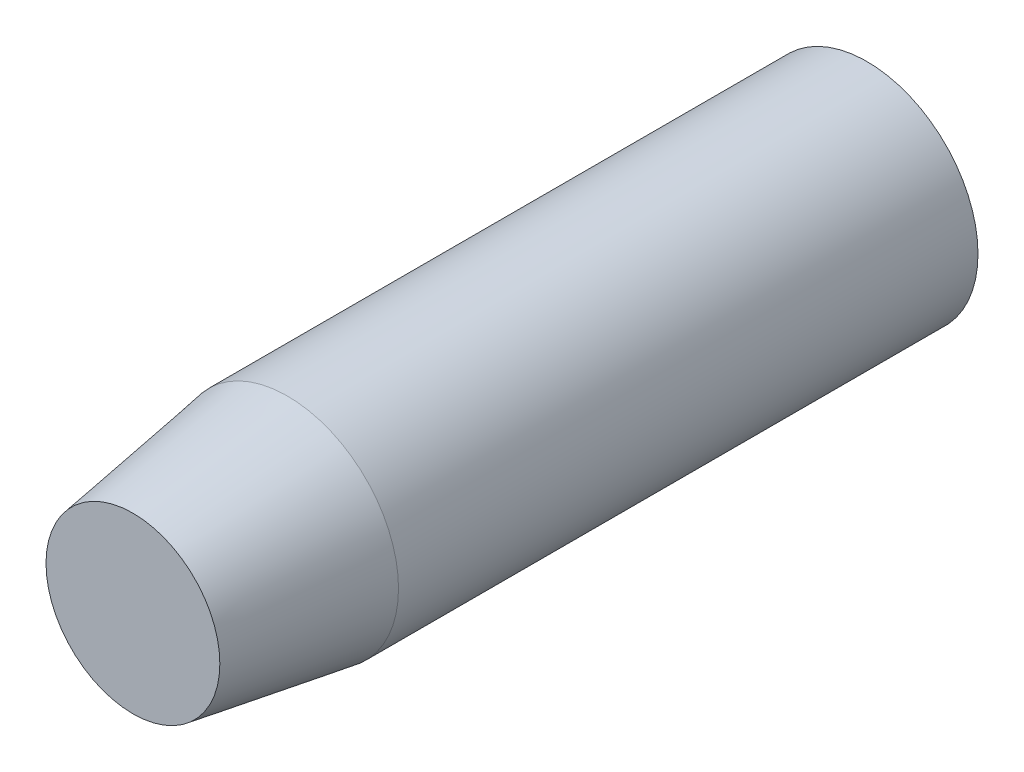
ISO-10303-21;
HEADER;
FILE_DESCRIPTION(('STEP AP214'),'2;1');
FILE_NAME('part.step','',(''),(''),'','','');
FILE_SCHEMA(('AUTOMOTIVE_DESIGN { 1 0 10303 214 1 1 1 1 }'));
ENDSEC;
DATA;
#1=APPLICATION_CONTEXT('core data for automotive mechanical design processes');
#2=APPLICATION_PROTOCOL_DEFINITION('international standard','automotive_design',2000,#1);
#3=PRODUCT_CONTEXT('',#1,'mechanical');
#4=PRODUCT('Part','Part','',(#3));
#5=PRODUCT_RELATED_PRODUCT_CATEGORY('part','',(#4));
#6=PRODUCT_DEFINITION_FORMATION('','',#4);
#7=PRODUCT_DEFINITION_CONTEXT('part definition',#1,'design');
#8=PRODUCT_DEFINITION('design','',#6,#7);
#9=PRODUCT_DEFINITION_SHAPE('','',#8);
#10=(LENGTH_UNIT() NAMED_UNIT(*) SI_UNIT(.MILLI.,.METRE.));
#11=(NAMED_UNIT(*) PLANE_ANGLE_UNIT() SI_UNIT($,.RADIAN.));
#12=(NAMED_UNIT(*) SI_UNIT($,.STERADIAN.) SOLID_ANGLE_UNIT());
#13=UNCERTAINTY_MEASURE_WITH_UNIT(LENGTH_MEASURE(1.E-05),#10,'distance_accuracy_value','');
#14=(GEOMETRIC_REPRESENTATION_CONTEXT(3) GLOBAL_UNCERTAINTY_ASSIGNED_CONTEXT((#13)) GLOBAL_UNIT_ASSIGNED_CONTEXT((#10,
#11,#12)) REPRESENTATION_CONTEXT('',''));
#15=CARTESIAN_POINT('',(0.,0.,0.));
#16=DIRECTION('',(0.,0.,1.));
#17=DIRECTION('',(1.,0.,0.));
#18=AXIS2_PLACEMENT_3D('',#15,#16,#17);
#19=CARTESIAN_POINT('',(0.,0.,60.325));
#20=DIRECTION('',(0.,0.,-1.));
#21=DIRECTION('',(-1.,0.,0.));
#22=AXIS2_PLACEMENT_3D('',#19,#20,#21);
#23=CYLINDRICAL_SURFACE('',#22,18.25625);
#24=CARTESIAN_POINT('',(0.,0.,34.9250000000015));
#25=DIRECTION('',(0.,0.,1.));
#26=DIRECTION('',(1.,0.,0.));
#27=AXIS2_PLACEMENT_3D('',#24,#25,#26);
#28=CIRCLE('',#27,18.25625);
#29=CARTESIAN_POINT('',(18.25625,0.,34.9250000000015));
#30=VERTEX_POINT('',#29);
#31=EDGE_CURVE('E10',#30,#30,#28,.F.);
#32=ORIENTED_EDGE('',*,*,#31,.T.);
#33=EDGE_LOOP('',(#32));
#34=FACE_BOUND('',#33,.T.);
#35=CARTESIAN_POINT('',(0.,0.,-60.325));
#36=DIRECTION('',(0.,0.,1.));
#37=DIRECTION('',(1.,0.,0.));
#38=AXIS2_PLACEMENT_3D('',#35,#36,#37);
#39=CIRCLE('',#38,18.25625);
#40=CARTESIAN_POINT('',(18.25625,0.,-60.325));
#41=VERTEX_POINT('',#40);
#42=EDGE_CURVE('E41',#41,#41,#39,.T.);
#43=ORIENTED_EDGE('',*,*,#42,.T.);
#44=EDGE_LOOP('',(#43));
#45=FACE_BOUND('',#44,.T.);
#46=ADVANCED_FACE('F30',(#34,#45),#23,.T.);
#47=CARTESIAN_POINT('',(0.,0.,60.325));
#48=DIRECTION('',(0.,0.,1.));
#49=DIRECTION('',(1.,0.,0.));
#50=AXIS2_PLACEMENT_3D('',#47,#48,#49);
#51=PLANE('',#50);
#52=CARTESIAN_POINT('',(0.,0.,60.325));
#53=DIRECTION('',(0.,0.,1.));
#54=DIRECTION('',(1.,0.,0.));
#55=AXIS2_PLACEMENT_3D('',#52,#53,#54);
#56=CIRCLE('',#55,14.2875000000003);
#57=CARTESIAN_POINT('',(14.2875000000003,0.,60.325));
#58=VERTEX_POINT('',#57);
#59=EDGE_CURVE('E37',#58,#58,#56,.T.);
#60=ORIENTED_EDGE('',*,*,#59,.T.);
#61=EDGE_LOOP('',(#60));
#62=FACE_BOUND('',#61,.T.);
#63=ADVANCED_FACE('F51',(#62),#51,.T.);
#64=CARTESIAN_POINT('',(0.,0.,-60.325));
#65=DIRECTION('',(0.,0.,1.));
#66=DIRECTION('',(1.,0.,0.));
#67=AXIS2_PLACEMENT_3D('',#64,#65,#66);
#68=PLANE('',#67);
#69=ORIENTED_EDGE('',*,*,#42,.F.);
#70=EDGE_LOOP('',(#69));
#71=FACE_BOUND('',#70,.T.);
#72=ADVANCED_FACE('F49',(#71),#68,.F.);
#73=CARTESIAN_POINT('',(0.,0.,60.325));
#74=DIRECTION('',(0.,0.,-1.));
#75=DIRECTION('',(-1.,0.,0.));
#76=AXIS2_PLACEMENT_3D('',#73,#74,#75);
#77=CONICAL_SURFACE('',#76,14.2875000000003,0.154996741923938);
#78=ORIENTED_EDGE('',*,*,#31,.F.);
#79=EDGE_LOOP('',(#78));
#80=FACE_BOUND('',#79,.T.);
#81=ORIENTED_EDGE('',*,*,#59,.F.);
#82=EDGE_LOOP('',(#81));
#83=FACE_BOUND('',#82,.T.);
#84=ADVANCED_FACE('F32',(#80,#83),#77,.T.);
#85=CLOSED_SHELL('',(#46,#63,#72,#84));
#86=MANIFOLD_SOLID_BREP('B2',#85);
#87=ADVANCED_BREP_SHAPE_REPRESENTATION('',(#18,#86),#14);
#88=SHAPE_DEFINITION_REPRESENTATION(#9,#87);
ENDSEC;
END-ISO-10303-21;
